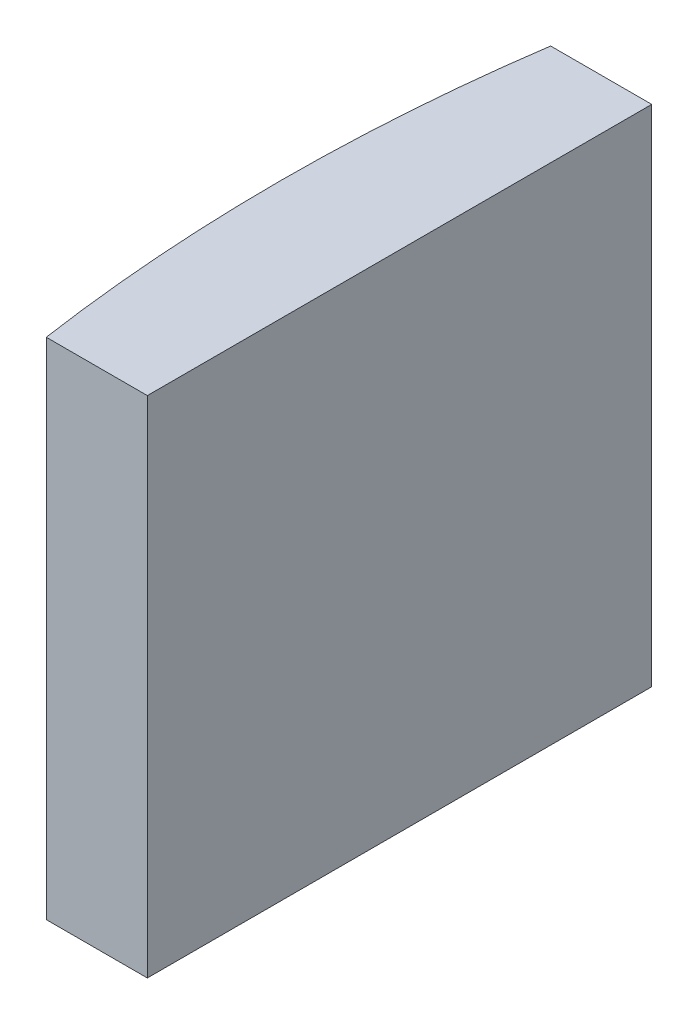
ISO-10303-21;
HEADER;
FILE_DESCRIPTION(('STEP AP214'),'2;1');
FILE_NAME('part.step','',(''),(''),'','','');
FILE_SCHEMA(('AUTOMOTIVE_DESIGN { 1 0 10303 214 1 1 1 1 }'));
ENDSEC;
DATA;
#1=APPLICATION_CONTEXT('core data for automotive mechanical design processes');
#2=APPLICATION_PROTOCOL_DEFINITION('international standard','automotive_design',2000,#1);
#3=PRODUCT_CONTEXT('',#1,'mechanical');
#4=PRODUCT('Part','Part','',(#3));
#5=PRODUCT_RELATED_PRODUCT_CATEGORY('part','',(#4));
#6=PRODUCT_DEFINITION_FORMATION('','',#4);
#7=PRODUCT_DEFINITION_CONTEXT('part definition',#1,'design');
#8=PRODUCT_DEFINITION('design','',#6,#7);
#9=PRODUCT_DEFINITION_SHAPE('','',#8);
#10=(LENGTH_UNIT() NAMED_UNIT(*) SI_UNIT(.MILLI.,.METRE.));
#11=(NAMED_UNIT(*) PLANE_ANGLE_UNIT() SI_UNIT($,.RADIAN.));
#12=(NAMED_UNIT(*) SI_UNIT($,.STERADIAN.) SOLID_ANGLE_UNIT());
#13=UNCERTAINTY_MEASURE_WITH_UNIT(LENGTH_MEASURE(1.E-05),#10,'distance_accuracy_value','');
#14=(GEOMETRIC_REPRESENTATION_CONTEXT(3) GLOBAL_UNCERTAINTY_ASSIGNED_CONTEXT((#13)) GLOBAL_UNIT_ASSIGNED_CONTEXT((#10,
#11,#12)) REPRESENTATION_CONTEXT('',''));
#15=CARTESIAN_POINT('',(0.,0.,0.));
#16=DIRECTION('',(0.,0.,1.));
#17=DIRECTION('',(1.,0.,0.));
#18=AXIS2_PLACEMENT_3D('',#15,#16,#17);
#19=CARTESIAN_POINT('',(4.35520433485127,10.,0.));
#20=DIRECTION('',(0.,-1.,0.));
#21=DIRECTION('',(0.,0.,-1.));
#22=AXIS2_PLACEMENT_3D('',#19,#20,#21);
#23=CYLINDRICAL_SURFACE('',#22,34.35);
#24=CARTESIAN_POINT('',(4.35520433485127,0.,0.));
#25=DIRECTION('',(0.,1.,0.));
#26=DIRECTION('',(0.,0.,1.));
#27=AXIS2_PLACEMENT_3D('',#24,#25,#26);
#28=CIRCLE('',#27,34.35);
#29=CARTESIAN_POINT('',(-29.6289463827995,0.,-5.));
#30=VERTEX_POINT('',#29);
#31=CARTESIAN_POINT('',(-29.6289463827995,0.,5.));
#32=VERTEX_POINT('',#31);
#33=EDGE_CURVE('E100',#30,#32,#28,.T.);
#34=ORIENTED_EDGE('',*,*,#33,.T.);
#35=DIRECTION('',(0.,-1.,0.));
#36=VECTOR('',#35,1.);
#37=CARTESIAN_POINT('',(-29.6289463827995,10.,5.));
#38=LINE('',#37,#36);
#39=CARTESIAN_POINT('',(-29.6289463827995,10.,5.));
#40=VERTEX_POINT('',#39);
#41=EDGE_CURVE('E11',#40,#32,#38,.T.);
#42=ORIENTED_EDGE('',*,*,#41,.F.);
#43=CARTESIAN_POINT('',(4.35520433485127,10.,0.));
#44=DIRECTION('',(0.,1.,0.));
#45=DIRECTION('',(0.,0.,1.));
#46=AXIS2_PLACEMENT_3D('',#43,#44,#45);
#47=CIRCLE('',#46,34.35);
#48=CARTESIAN_POINT('',(-29.6289463827995,10.,-5.));
#49=VERTEX_POINT('',#48);
#50=EDGE_CURVE('E88',#49,#40,#47,.T.);
#51=ORIENTED_EDGE('',*,*,#50,.F.);
#52=DIRECTION('',(0.,-1.,0.));
#53=VECTOR('',#52,1.);
#54=CARTESIAN_POINT('',(-29.6289463827995,10.,-5.));
#55=LINE('',#54,#53);
#56=EDGE_CURVE('E96',#49,#30,#55,.T.);
#57=ORIENTED_EDGE('',*,*,#56,.T.);
#58=EDGE_LOOP('',(#34,#42,#51,#57));
#59=FACE_BOUND('',#58,.T.);
#60=ADVANCED_FACE('F37',(#59),#23,.T.);
#61=CARTESIAN_POINT('',(-29.6289463827995,10.,5.));
#62=DIRECTION('',(0.,0.,-1.));
#63=DIRECTION('',(-1.,0.,0.));
#64=AXIS2_PLACEMENT_3D('',#61,#62,#63);
#65=PLANE('',#64);
#66=DIRECTION('',(1.,0.,0.));
#67=VECTOR('',#66,1.);
#68=CARTESIAN_POINT('',(-29.6289463827995,0.,5.));
#69=LINE('',#68,#67);
#70=CARTESIAN_POINT('',(-27.6247956651487,0.,5.));
#71=VERTEX_POINT('',#70);
#72=EDGE_CURVE('E92',#32,#71,#69,.T.);
#73=ORIENTED_EDGE('',*,*,#72,.T.);
#74=DIRECTION('',(0.,-1.,0.));
#75=VECTOR('',#74,1.);
#76=CARTESIAN_POINT('',(-27.6247956651487,10.,5.));
#77=LINE('',#76,#75);
#78=CARTESIAN_POINT('',(-27.6247956651487,10.,5.));
#79=VERTEX_POINT('',#78);
#80=EDGE_CURVE('E45',#79,#71,#77,.T.);
#81=ORIENTED_EDGE('',*,*,#80,.F.);
#82=DIRECTION('',(1.,0.,0.));
#83=VECTOR('',#82,1.);
#84=CARTESIAN_POINT('',(-29.6289463827995,10.,5.));
#85=LINE('',#84,#83);
#86=EDGE_CURVE('E83',#40,#79,#85,.T.);
#87=ORIENTED_EDGE('',*,*,#86,.F.);
#88=ORIENTED_EDGE('',*,*,#41,.T.);
#89=EDGE_LOOP('',(#73,#81,#87,#88));
#90=FACE_BOUND('',#89,.T.);
#91=ADVANCED_FACE('F91',(#90),#65,.F.);
#92=CARTESIAN_POINT('',(-27.6247956651487,10.,-4.99999999999999));
#93=DIRECTION('',(-1.,0.,0.));
#94=DIRECTION('',(0.,0.,1.));
#95=AXIS2_PLACEMENT_3D('',#92,#93,#94);
#96=PLANE('',#95);
#97=DIRECTION('',(0.,0.,-1.));
#98=VECTOR('',#97,1.);
#99=CARTESIAN_POINT('',(-27.6247956651487,0.,-4.99999999999999));
#100=LINE('',#99,#98);
#101=CARTESIAN_POINT('',(-27.6247956651487,0.,-4.99999999999999));
#102=VERTEX_POINT('',#101);
#103=EDGE_CURVE('E70',#71,#102,#100,.T.);
#104=ORIENTED_EDGE('',*,*,#103,.T.);
#105=DIRECTION('',(0.,-1.,0.));
#106=VECTOR('',#105,1.);
#107=CARTESIAN_POINT('',(-27.6247956651487,10.,-4.99999999999999));
#108=LINE('',#107,#106);
#109=CARTESIAN_POINT('',(-27.6247956651487,10.,-4.99999999999999));
#110=VERTEX_POINT('',#109);
#111=EDGE_CURVE('E93',#110,#102,#108,.T.);
#112=ORIENTED_EDGE('',*,*,#111,.F.);
#113=DIRECTION('',(0.,0.,-1.));
#114=VECTOR('',#113,1.);
#115=CARTESIAN_POINT('',(-27.6247956651487,10.,-4.99999999999999));
#116=LINE('',#115,#114);
#117=EDGE_CURVE('E86',#79,#110,#116,.T.);
#118=ORIENTED_EDGE('',*,*,#117,.F.);
#119=ORIENTED_EDGE('',*,*,#80,.T.);
#120=EDGE_LOOP('',(#104,#112,#118,#119));
#121=FACE_BOUND('',#120,.T.);
#122=ADVANCED_FACE('F94',(#121),#96,.F.);
#123=CARTESIAN_POINT('',(-29.6289463827995,10.,-5.));
#124=DIRECTION('',(0.,0.,1.));
#125=DIRECTION('',(1.,0.,0.));
#126=AXIS2_PLACEMENT_3D('',#123,#124,#125);
#127=PLANE('',#126);
#128=DIRECTION('',(-1.,0.,0.));
#129=VECTOR('',#128,1.);
#130=CARTESIAN_POINT('',(-29.6289463827995,0.,-5.));
#131=LINE('',#130,#129);
#132=EDGE_CURVE('E76',#102,#30,#131,.T.);
#133=ORIENTED_EDGE('',*,*,#132,.T.);
#134=ORIENTED_EDGE('',*,*,#56,.F.);
#135=DIRECTION('',(-1.,0.,0.));
#136=VECTOR('',#135,1.);
#137=CARTESIAN_POINT('',(-29.6289463827995,10.,-5.));
#138=LINE('',#137,#136);
#139=EDGE_CURVE('E53',#110,#49,#138,.T.);
#140=ORIENTED_EDGE('',*,*,#139,.F.);
#141=ORIENTED_EDGE('',*,*,#111,.T.);
#142=EDGE_LOOP('',(#133,#134,#140,#141));
#143=FACE_BOUND('',#142,.T.);
#144=ADVANCED_FACE('F107',(#143),#127,.F.);
#145=CARTESIAN_POINT('',(4.35520433485127,10.,0.));
#146=DIRECTION('',(0.,1.,0.));
#147=DIRECTION('',(0.,0.,1.));
#148=AXIS2_PLACEMENT_3D('',#145,#146,#147);
#149=PLANE('',#148);
#150=ORIENTED_EDGE('',*,*,#50,.T.);
#151=ORIENTED_EDGE('',*,*,#86,.T.);
#152=ORIENTED_EDGE('',*,*,#117,.T.);
#153=ORIENTED_EDGE('',*,*,#139,.T.);
#154=EDGE_LOOP('',(#150,#151,#152,#153));
#155=FACE_BOUND('',#154,.T.);
#156=ADVANCED_FACE('F84',(#155),#149,.T.);
#157=CARTESIAN_POINT('',(4.35520433485127,0.,0.));
#158=DIRECTION('',(0.,1.,0.));
#159=DIRECTION('',(0.,0.,1.));
#160=AXIS2_PLACEMENT_3D('',#157,#158,#159);
#161=PLANE('',#160);
#162=ORIENTED_EDGE('',*,*,#33,.F.);
#163=ORIENTED_EDGE('',*,*,#132,.F.);
#164=ORIENTED_EDGE('',*,*,#103,.F.);
#165=ORIENTED_EDGE('',*,*,#72,.F.);
#166=EDGE_LOOP('',(#162,#163,#164,#165));
#167=FACE_BOUND('',#166,.T.);
#168=ADVANCED_FACE('F110',(#167),#161,.F.);
#169=CLOSED_SHELL('',(#60,#91,#122,#144,#156,#168));
#170=MANIFOLD_SOLID_BREP('B2',#169);
#171=ADVANCED_BREP_SHAPE_REPRESENTATION('',(#18,#170),#14);
#172=SHAPE_DEFINITION_REPRESENTATION(#9,#171);
ENDSEC;
END-ISO-10303-21;
